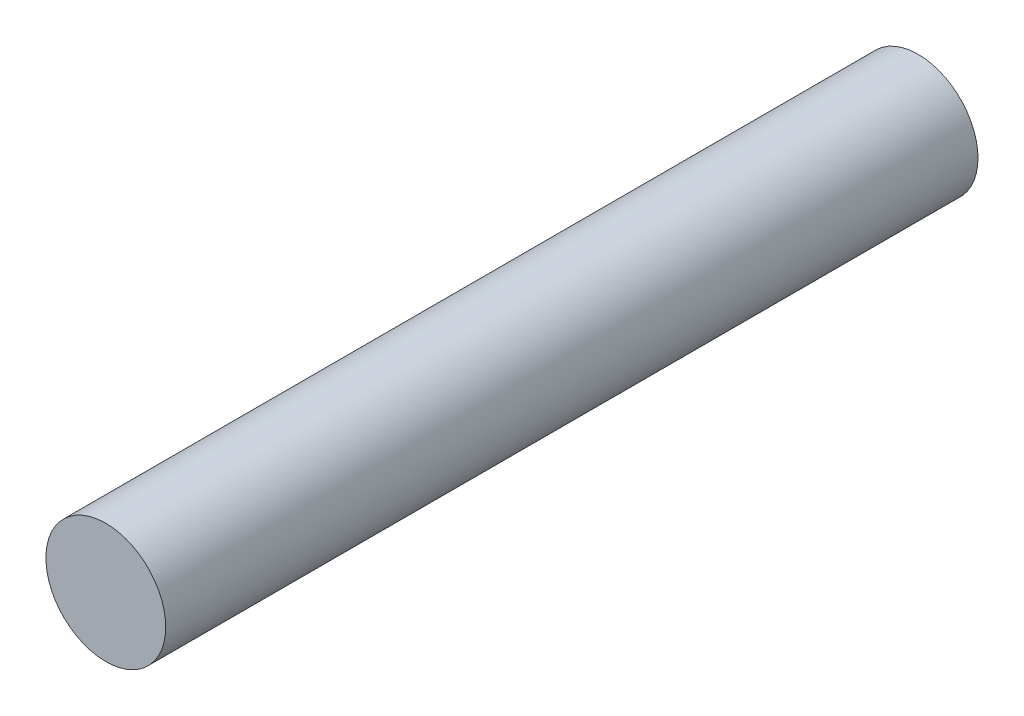
ISO-10303-21;
HEADER;
FILE_DESCRIPTION(('STEP AP214'),'2;1');
FILE_NAME('part.step','',(''),(''),'','','');
FILE_SCHEMA(('AUTOMOTIVE_DESIGN { 1 0 10303 214 1 1 1 1 }'));
ENDSEC;
DATA;
#1=APPLICATION_CONTEXT('core data for automotive mechanical design processes');
#2=APPLICATION_PROTOCOL_DEFINITION('international standard','automotive_design',2000,#1);
#3=PRODUCT_CONTEXT('',#1,'mechanical');
#4=PRODUCT('Part','Part','',(#3));
#5=PRODUCT_RELATED_PRODUCT_CATEGORY('part','',(#4));
#6=PRODUCT_DEFINITION_FORMATION('','',#4);
#7=PRODUCT_DEFINITION_CONTEXT('part definition',#1,'design');
#8=PRODUCT_DEFINITION('design','',#6,#7);
#9=PRODUCT_DEFINITION_SHAPE('','',#8);
#10=(LENGTH_UNIT() NAMED_UNIT(*) SI_UNIT(.MILLI.,.METRE.));
#11=(NAMED_UNIT(*) PLANE_ANGLE_UNIT() SI_UNIT($,.RADIAN.));
#12=(NAMED_UNIT(*) SI_UNIT($,.STERADIAN.) SOLID_ANGLE_UNIT());
#13=UNCERTAINTY_MEASURE_WITH_UNIT(LENGTH_MEASURE(1.E-05),#10,'distance_accuracy_value','');
#14=(GEOMETRIC_REPRESENTATION_CONTEXT(3) GLOBAL_UNCERTAINTY_ASSIGNED_CONTEXT((#13)) GLOBAL_UNIT_ASSIGNED_CONTEXT((#10,
#11,#12)) REPRESENTATION_CONTEXT('',''));
#15=CARTESIAN_POINT('',(0.,0.,0.));
#16=DIRECTION('',(0.,0.,1.));
#17=DIRECTION('',(1.,0.,0.));
#18=AXIS2_PLACEMENT_3D('',#15,#16,#17);
#19=CARTESIAN_POINT('',(0.,0.,-10.));
#20=DIRECTION('',(0.,0.,1.));
#21=DIRECTION('',(1.,0.,0.));
#22=AXIS2_PLACEMENT_3D('',#19,#20,#21);
#23=CYLINDRICAL_SURFACE('',#22,1.475);
#24=CARTESIAN_POINT('',(0.,0.,-10.));
#25=DIRECTION('',(0.,0.,1.));
#26=DIRECTION('',(1.,0.,0.));
#27=AXIS2_PLACEMENT_3D('',#24,#25,#26);
#28=CIRCLE('',#27,1.475);
#29=CARTESIAN_POINT('',(1.475,0.,-10.));
#30=VERTEX_POINT('',#29);
#31=EDGE_CURVE('E10',#30,#30,#28,.T.);
#32=ORIENTED_EDGE('',*,*,#31,.T.);
#33=EDGE_LOOP('',(#32));
#34=FACE_BOUND('',#33,.T.);
#35=CARTESIAN_POINT('',(0.,0.,10.));
#36=DIRECTION('',(0.,0.,1.));
#37=DIRECTION('',(1.,0.,0.));
#38=AXIS2_PLACEMENT_3D('',#35,#36,#37);
#39=CIRCLE('',#38,1.475);
#40=CARTESIAN_POINT('',(1.475,0.,10.));
#41=VERTEX_POINT('',#40);
#42=EDGE_CURVE('E36',#41,#41,#39,.T.);
#43=ORIENTED_EDGE('',*,*,#42,.F.);
#44=EDGE_LOOP('',(#43));
#45=FACE_BOUND('',#44,.T.);
#46=ADVANCED_FACE('F30',(#34,#45),#23,.T.);
#47=CARTESIAN_POINT('',(0.,0.,-10.));
#48=DIRECTION('',(0.,0.,1.));
#49=DIRECTION('',(1.,0.,0.));
#50=AXIS2_PLACEMENT_3D('',#47,#48,#49);
#51=PLANE('',#50);
#52=ORIENTED_EDGE('',*,*,#31,.F.);
#53=EDGE_LOOP('',(#52));
#54=FACE_BOUND('',#53,.T.);
#55=ADVANCED_FACE('F45',(#54),#51,.F.);
#56=CARTESIAN_POINT('',(0.,0.,10.));
#57=DIRECTION('',(0.,0.,1.));
#58=DIRECTION('',(1.,0.,0.));
#59=AXIS2_PLACEMENT_3D('',#56,#57,#58);
#60=PLANE('',#59);
#61=ORIENTED_EDGE('',*,*,#42,.T.);
#62=EDGE_LOOP('',(#61));
#63=FACE_BOUND('',#62,.T.);
#64=ADVANCED_FACE('F42',(#63),#60,.T.);
#65=CLOSED_SHELL('',(#46,#55,#64));
#66=MANIFOLD_SOLID_BREP('B2',#65);
#67=ADVANCED_BREP_SHAPE_REPRESENTATION('',(#18,#66),#14);
#68=SHAPE_DEFINITION_REPRESENTATION(#9,#67);
ENDSEC;
END-ISO-10303-21;
